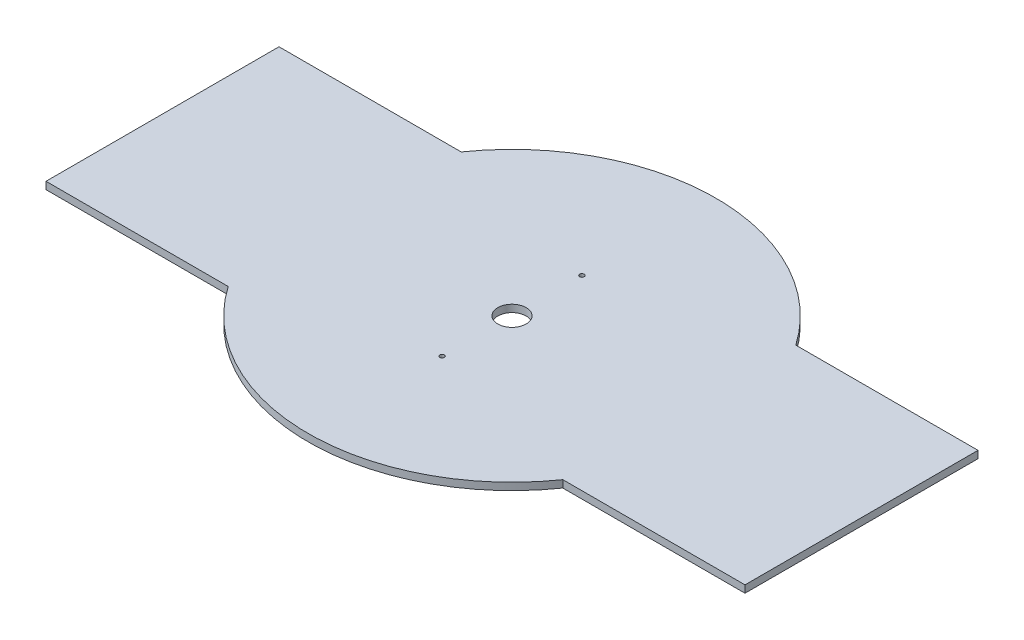
ISO-10303-21;
HEADER;
FILE_DESCRIPTION(('STEP AP214'),'2;1');
FILE_NAME('part.step','',(''),(''),'','','');
FILE_SCHEMA(('AUTOMOTIVE_DESIGN { 1 0 10303 214 1 1 1 1 }'));
ENDSEC;
DATA;
#1=APPLICATION_CONTEXT('core data for automotive mechanical design processes');
#2=APPLICATION_PROTOCOL_DEFINITION('international standard','automotive_design',2000,#1);
#3=PRODUCT_CONTEXT('',#1,'mechanical');
#4=PRODUCT('Part','Part','',(#3));
#5=PRODUCT_RELATED_PRODUCT_CATEGORY('part','',(#4));
#6=PRODUCT_DEFINITION_FORMATION('','',#4);
#7=PRODUCT_DEFINITION_CONTEXT('part definition',#1,'design');
#8=PRODUCT_DEFINITION('design','',#6,#7);
#9=PRODUCT_DEFINITION_SHAPE('','',#8);
#10=(LENGTH_UNIT() NAMED_UNIT(*) SI_UNIT(.MILLI.,.METRE.));
#11=(NAMED_UNIT(*) PLANE_ANGLE_UNIT() SI_UNIT($,.RADIAN.));
#12=(NAMED_UNIT(*) SI_UNIT($,.STERADIAN.) SOLID_ANGLE_UNIT());
#13=UNCERTAINTY_MEASURE_WITH_UNIT(LENGTH_MEASURE(1.E-05),#10,'distance_accuracy_value','');
#14=(GEOMETRIC_REPRESENTATION_CONTEXT(3) GLOBAL_UNCERTAINTY_ASSIGNED_CONTEXT((#13)) GLOBAL_UNIT_ASSIGNED_CONTEXT((#10,
#11,#12)) REPRESENTATION_CONTEXT('',''));
#15=CARTESIAN_POINT('',(0.,0.,0.));
#16=DIRECTION('',(0.,0.,1.));
#17=DIRECTION('',(1.,0.,0.));
#18=AXIS2_PLACEMENT_3D('',#15,#16,#17);
#19=CARTESIAN_POINT('',(0.,2.5,0.));
#20=DIRECTION('',(0.,-1.,0.));
#21=DIRECTION('',(0.,0.,-1.));
#22=AXIS2_PLACEMENT_3D('',#19,#20,#21);
#23=CYLINDRICAL_SURFACE('',#22,70.);
#24=CARTESIAN_POINT('',(0.,0.,0.));
#25=DIRECTION('',(0.,1.,0.));
#26=DIRECTION('',(0.,0.,1.));
#27=AXIS2_PLACEMENT_3D('',#24,#25,#26);
#28=CIRCLE('',#27,70.);
#29=CARTESIAN_POINT('',(-57.4456264653803,0.,40.));
#30=VERTEX_POINT('',#29);
#31=CARTESIAN_POINT('',(57.4456264653803,0.,40.));
#32=VERTEX_POINT('',#31);
#33=EDGE_CURVE('E162',#30,#32,#28,.T.);
#34=ORIENTED_EDGE('',*,*,#33,.T.);
#35=DIRECTION('',(0.,-1.,0.));
#36=VECTOR('',#35,1.);
#37=CARTESIAN_POINT('',(57.4456264653803,2.5,40.));
#38=LINE('',#37,#36);
#39=CARTESIAN_POINT('',(57.4456264653803,2.5,40.));
#40=VERTEX_POINT('',#39);
#41=EDGE_CURVE('E11',#40,#32,#38,.T.);
#42=ORIENTED_EDGE('',*,*,#41,.F.);
#43=CARTESIAN_POINT('',(0.,2.5,0.));
#44=DIRECTION('',(0.,1.,0.));
#45=DIRECTION('',(0.,0.,1.));
#46=AXIS2_PLACEMENT_3D('',#43,#44,#45);
#47=CIRCLE('',#46,70.);
#48=CARTESIAN_POINT('',(-57.4456264653803,2.5,40.));
#49=VERTEX_POINT('',#48);
#50=EDGE_CURVE('E200',#49,#40,#47,.T.);
#51=ORIENTED_EDGE('',*,*,#50,.F.);
#52=DIRECTION('',(0.,-1.,0.));
#53=VECTOR('',#52,1.);
#54=CARTESIAN_POINT('',(-57.4456264653803,2.5,40.));
#55=LINE('',#54,#53);
#56=EDGE_CURVE('E161',#49,#30,#55,.T.);
#57=ORIENTED_EDGE('',*,*,#56,.T.);
#58=EDGE_LOOP('',(#34,#42,#51,#57));
#59=FACE_BOUND('',#58,.T.);
#60=ADVANCED_FACE('F45',(#59),#23,.T.);
#61=CARTESIAN_POINT('',(0.,2.5,40.));
#62=DIRECTION('',(0.,0.,-1.));
#63=DIRECTION('',(-1.,0.,0.));
#64=AXIS2_PLACEMENT_3D('',#61,#62,#63);
#65=PLANE('',#64);
#66=DIRECTION('',(1.,0.,0.));
#67=VECTOR('',#66,1.);
#68=CARTESIAN_POINT('',(0.,0.,40.));
#69=LINE('',#68,#67);
#70=CARTESIAN_POINT('',(120.,0.,40.));
#71=VERTEX_POINT('',#70);
#72=EDGE_CURVE('E166',#32,#71,#69,.T.);
#73=ORIENTED_EDGE('',*,*,#72,.T.);
#74=DIRECTION('',(0.,-1.,0.));
#75=VECTOR('',#74,1.);
#76=CARTESIAN_POINT('',(120.,2.5,40.));
#77=LINE('',#76,#75);
#78=CARTESIAN_POINT('',(120.,2.5,40.));
#79=VERTEX_POINT('',#78);
#80=EDGE_CURVE('E54',#79,#71,#77,.T.);
#81=ORIENTED_EDGE('',*,*,#80,.F.);
#82=DIRECTION('',(1.,0.,0.));
#83=VECTOR('',#82,1.);
#84=CARTESIAN_POINT('',(0.,2.5,40.));
#85=LINE('',#84,#83);
#86=EDGE_CURVE('E104',#40,#79,#85,.T.);
#87=ORIENTED_EDGE('',*,*,#86,.F.);
#88=ORIENTED_EDGE('',*,*,#41,.T.);
#89=EDGE_LOOP('',(#73,#81,#87,#88));
#90=FACE_BOUND('',#89,.T.);
#91=ADVANCED_FACE('F219',(#90),#65,.F.);
#92=CARTESIAN_POINT('',(120.,2.5,0.));
#93=DIRECTION('',(1.,0.,0.));
#94=DIRECTION('',(0.,0.,-1.));
#95=AXIS2_PLACEMENT_3D('',#92,#93,#94);
#96=PLANE('',#95);
#97=DIRECTION('',(0.,0.,1.));
#98=VECTOR('',#97,1.);
#99=CARTESIAN_POINT('',(120.,0.,0.));
#100=LINE('',#99,#98);
#101=CARTESIAN_POINT('',(120.,0.,-40.));
#102=VERTEX_POINT('',#101);
#103=EDGE_CURVE('E170',#102,#71,#100,.T.);
#104=ORIENTED_EDGE('',*,*,#103,.F.);
#105=DIRECTION('',(0.,-1.,0.));
#106=VECTOR('',#105,1.);
#107=CARTESIAN_POINT('',(120.,2.5,-40.));
#108=LINE('',#107,#106);
#109=CARTESIAN_POINT('',(120.,2.5,-40.));
#110=VERTEX_POINT('',#109);
#111=EDGE_CURVE('E210',#110,#102,#108,.T.);
#112=ORIENTED_EDGE('',*,*,#111,.F.);
#113=DIRECTION('',(0.,0.,1.));
#114=VECTOR('',#113,1.);
#115=CARTESIAN_POINT('',(120.,2.5,0.));
#116=LINE('',#115,#114);
#117=EDGE_CURVE('E218',#110,#79,#116,.T.);
#118=ORIENTED_EDGE('',*,*,#117,.T.);
#119=ORIENTED_EDGE('',*,*,#80,.T.);
#120=EDGE_LOOP('',(#104,#112,#118,#119));
#121=FACE_BOUND('',#120,.T.);
#122=ADVANCED_FACE('F216',(#121),#96,.T.);
#123=CARTESIAN_POINT('',(0.,2.5,-40.));
#124=DIRECTION('',(0.,0.,-1.));
#125=DIRECTION('',(-1.,0.,0.));
#126=AXIS2_PLACEMENT_3D('',#123,#124,#125);
#127=PLANE('',#126);
#128=DIRECTION('',(1.,0.,0.));
#129=VECTOR('',#128,1.);
#130=CARTESIAN_POINT('',(0.,0.,-40.));
#131=LINE('',#130,#129);
#132=CARTESIAN_POINT('',(57.4456264653803,0.,-40.));
#133=VERTEX_POINT('',#132);
#134=EDGE_CURVE('E174',#133,#102,#131,.T.);
#135=ORIENTED_EDGE('',*,*,#134,.F.);
#136=DIRECTION('',(0.,-1.,0.));
#137=VECTOR('',#136,1.);
#138=CARTESIAN_POINT('',(57.4456264653803,2.5,-40.));
#139=LINE('',#138,#137);
#140=CARTESIAN_POINT('',(57.4456264653803,2.5,-40.));
#141=VERTEX_POINT('',#140);
#142=EDGE_CURVE('E207',#141,#133,#139,.T.);
#143=ORIENTED_EDGE('',*,*,#142,.F.);
#144=DIRECTION('',(1.,0.,0.));
#145=VECTOR('',#144,1.);
#146=CARTESIAN_POINT('',(0.,2.5,-40.));
#147=LINE('',#146,#145);
#148=EDGE_CURVE('E143',#141,#110,#147,.T.);
#149=ORIENTED_EDGE('',*,*,#148,.T.);
#150=ORIENTED_EDGE('',*,*,#111,.T.);
#151=EDGE_LOOP('',(#135,#143,#149,#150));
#152=FACE_BOUND('',#151,.T.);
#153=ADVANCED_FACE('F228',(#152),#127,.T.);
#154=CARTESIAN_POINT('',(0.,2.5,0.));
#155=DIRECTION('',(0.,-1.,0.));
#156=DIRECTION('',(0.,0.,-1.));
#157=AXIS2_PLACEMENT_3D('',#154,#155,#156);
#158=CYLINDRICAL_SURFACE('',#157,70.);
#159=CARTESIAN_POINT('',(0.,0.,0.));
#160=DIRECTION('',(0.,1.,0.));
#161=DIRECTION('',(0.,0.,1.));
#162=AXIS2_PLACEMENT_3D('',#159,#160,#161);
#163=CIRCLE('',#162,70.);
#164=CARTESIAN_POINT('',(-57.4456264653803,0.,-40.));
#165=VERTEX_POINT('',#164);
#166=EDGE_CURVE('E178',#133,#165,#163,.T.);
#167=ORIENTED_EDGE('',*,*,#166,.T.);
#168=DIRECTION('',(0.,-1.,0.));
#169=VECTOR('',#168,1.);
#170=CARTESIAN_POINT('',(-57.4456264653803,2.5,-40.));
#171=LINE('',#170,#169);
#172=CARTESIAN_POINT('',(-57.4456264653803,2.5,-40.));
#173=VERTEX_POINT('',#172);
#174=EDGE_CURVE('E127',#173,#165,#171,.T.);
#175=ORIENTED_EDGE('',*,*,#174,.F.);
#176=CARTESIAN_POINT('',(0.,2.5,0.));
#177=DIRECTION('',(0.,1.,0.));
#178=DIRECTION('',(0.,0.,1.));
#179=AXIS2_PLACEMENT_3D('',#176,#177,#178);
#180=CIRCLE('',#179,70.);
#181=EDGE_CURVE('E138',#141,#173,#180,.T.);
#182=ORIENTED_EDGE('',*,*,#181,.F.);
#183=ORIENTED_EDGE('',*,*,#142,.T.);
#184=EDGE_LOOP('',(#167,#175,#182,#183));
#185=FACE_BOUND('',#184,.T.);
#186=ADVANCED_FACE('F265',(#185),#158,.T.);
#187=CARTESIAN_POINT('',(0.,2.5,-40.));
#188=DIRECTION('',(0.,0.,-1.));
#189=DIRECTION('',(-1.,0.,0.));
#190=AXIS2_PLACEMENT_3D('',#187,#188,#189);
#191=PLANE('',#190);
#192=DIRECTION('',(1.,0.,0.));
#193=VECTOR('',#192,1.);
#194=CARTESIAN_POINT('',(0.,0.,-40.));
#195=LINE('',#194,#193);
#196=CARTESIAN_POINT('',(-120.,0.,-40.));
#197=VERTEX_POINT('',#196);
#198=EDGE_CURVE('E125',#197,#165,#195,.T.);
#199=ORIENTED_EDGE('',*,*,#198,.F.);
#200=DIRECTION('',(0.,-1.,0.));
#201=VECTOR('',#200,1.);
#202=CARTESIAN_POINT('',(-120.,2.5,-40.));
#203=LINE('',#202,#201);
#204=CARTESIAN_POINT('',(-120.,2.5,-40.));
#205=VERTEX_POINT('',#204);
#206=EDGE_CURVE('E119',#205,#197,#203,.T.);
#207=ORIENTED_EDGE('',*,*,#206,.F.);
#208=DIRECTION('',(1.,0.,0.));
#209=VECTOR('',#208,1.);
#210=CARTESIAN_POINT('',(0.,2.5,-40.));
#211=LINE('',#210,#209);
#212=EDGE_CURVE('E123',#205,#173,#211,.T.);
#213=ORIENTED_EDGE('',*,*,#212,.T.);
#214=ORIENTED_EDGE('',*,*,#174,.T.);
#215=EDGE_LOOP('',(#199,#207,#213,#214));
#216=FACE_BOUND('',#215,.T.);
#217=ADVANCED_FACE('F121',(#216),#191,.T.);
#218=CARTESIAN_POINT('',(-120.,2.5,0.));
#219=DIRECTION('',(1.,0.,0.));
#220=DIRECTION('',(0.,0.,-1.));
#221=AXIS2_PLACEMENT_3D('',#218,#219,#220);
#222=PLANE('',#221);
#223=DIRECTION('',(0.,0.,1.));
#224=VECTOR('',#223,1.);
#225=CARTESIAN_POINT('',(-120.,0.,0.));
#226=LINE('',#225,#224);
#227=CARTESIAN_POINT('',(-120.,0.,40.));
#228=VERTEX_POINT('',#227);
#229=EDGE_CURVE('E90',#197,#228,#226,.T.);
#230=ORIENTED_EDGE('',*,*,#229,.T.);
#231=DIRECTION('',(0.,-1.,0.));
#232=VECTOR('',#231,1.);
#233=CARTESIAN_POINT('',(-120.,2.5,40.));
#234=LINE('',#233,#232);
#235=CARTESIAN_POINT('',(-120.,2.5,40.));
#236=VERTEX_POINT('',#235);
#237=EDGE_CURVE('E128',#236,#228,#234,.T.);
#238=ORIENTED_EDGE('',*,*,#237,.F.);
#239=DIRECTION('',(0.,0.,1.));
#240=VECTOR('',#239,1.);
#241=CARTESIAN_POINT('',(-120.,2.5,0.));
#242=LINE('',#241,#240);
#243=EDGE_CURVE('E130',#205,#236,#242,.T.);
#244=ORIENTED_EDGE('',*,*,#243,.F.);
#245=ORIENTED_EDGE('',*,*,#206,.T.);
#246=EDGE_LOOP('',(#230,#238,#244,#245));
#247=FACE_BOUND('',#246,.T.);
#248=ADVANCED_FACE('F131',(#247),#222,.F.);
#249=CARTESIAN_POINT('',(0.,2.5,-24.));
#250=DIRECTION('',(0.,-1.,0.));
#251=DIRECTION('',(0.,0.,-1.));
#252=AXIS2_PLACEMENT_3D('',#249,#250,#251);
#253=CYLINDRICAL_SURFACE('',#252,0.775);
#254=CARTESIAN_POINT('',(0.,2.5,-24.));
#255=DIRECTION('',(0.,1.,0.));
#256=DIRECTION('',(0.,0.,1.));
#257=AXIS2_PLACEMENT_3D('',#254,#255,#256);
#258=CIRCLE('',#257,0.775);
#259=CARTESIAN_POINT('',(0.,2.5,-23.225));
#260=VERTEX_POINT('',#259);
#261=EDGE_CURVE('E153',#260,#260,#258,.T.);
#262=ORIENTED_EDGE('',*,*,#261,.T.);
#263=EDGE_LOOP('',(#262));
#264=FACE_BOUND('',#263,.T.);
#265=CARTESIAN_POINT('',(0.,0.,-24.));
#266=DIRECTION('',(0.,1.,0.));
#267=DIRECTION('',(0.,0.,1.));
#268=AXIS2_PLACEMENT_3D('',#265,#266,#267);
#269=CIRCLE('',#268,0.775);
#270=CARTESIAN_POINT('',(0.,0.,-23.225));
#271=VERTEX_POINT('',#270);
#272=EDGE_CURVE('E192',#271,#271,#269,.T.);
#273=ORIENTED_EDGE('',*,*,#272,.F.);
#274=EDGE_LOOP('',(#273));
#275=FACE_BOUND('',#274,.T.);
#276=ADVANCED_FACE('F250',(#264,#275),#253,.F.);
#277=CARTESIAN_POINT('',(0.,2.5,24.));
#278=DIRECTION('',(0.,-1.,0.));
#279=DIRECTION('',(0.,0.,-1.));
#280=AXIS2_PLACEMENT_3D('',#277,#278,#279);
#281=CYLINDRICAL_SURFACE('',#280,0.775);
#282=CARTESIAN_POINT('',(0.,2.5,24.));
#283=DIRECTION('',(0.,1.,0.));
#284=DIRECTION('',(0.,0.,1.));
#285=AXIS2_PLACEMENT_3D('',#282,#283,#284);
#286=CIRCLE('',#285,0.775);
#287=CARTESIAN_POINT('',(0.,2.5,24.775));
#288=VERTEX_POINT('',#287);
#289=EDGE_CURVE('E149',#288,#288,#286,.T.);
#290=ORIENTED_EDGE('',*,*,#289,.T.);
#291=EDGE_LOOP('',(#290));
#292=FACE_BOUND('',#291,.T.);
#293=CARTESIAN_POINT('',(0.,0.,24.));
#294=DIRECTION('',(0.,1.,0.));
#295=DIRECTION('',(0.,0.,1.));
#296=AXIS2_PLACEMENT_3D('',#293,#294,#295);
#297=CIRCLE('',#296,0.775);
#298=CARTESIAN_POINT('',(0.,0.,24.775));
#299=VERTEX_POINT('',#298);
#300=EDGE_CURVE('E188',#299,#299,#297,.T.);
#301=ORIENTED_EDGE('',*,*,#300,.F.);
#302=EDGE_LOOP('',(#301));
#303=FACE_BOUND('',#302,.T.);
#304=ADVANCED_FACE('F242',(#292,#303),#281,.F.);
#305=CARTESIAN_POINT('',(0.,2.5,40.));
#306=DIRECTION('',(0.,0.,-1.));
#307=DIRECTION('',(-1.,0.,0.));
#308=AXIS2_PLACEMENT_3D('',#305,#306,#307);
#309=PLANE('',#308);
#310=DIRECTION('',(1.,0.,0.));
#311=VECTOR('',#310,1.);
#312=CARTESIAN_POINT('',(0.,0.,40.));
#313=LINE('',#312,#311);
#314=EDGE_CURVE('E96',#228,#30,#313,.T.);
#315=ORIENTED_EDGE('',*,*,#314,.T.);
#316=ORIENTED_EDGE('',*,*,#56,.F.);
#317=DIRECTION('',(1.,0.,0.));
#318=VECTOR('',#317,1.);
#319=CARTESIAN_POINT('',(0.,2.5,40.));
#320=LINE('',#319,#318);
#321=EDGE_CURVE('E62',#236,#49,#320,.T.);
#322=ORIENTED_EDGE('',*,*,#321,.F.);
#323=ORIENTED_EDGE('',*,*,#237,.T.);
#324=EDGE_LOOP('',(#315,#316,#322,#323));
#325=FACE_BOUND('',#324,.T.);
#326=ADVANCED_FACE('F239',(#325),#309,.F.);
#327=CARTESIAN_POINT('',(0.,2.5,0.));
#328=DIRECTION('',(0.,-1.,0.));
#329=DIRECTION('',(0.,0.,-1.));
#330=AXIS2_PLACEMENT_3D('',#327,#328,#329);
#331=CYLINDRICAL_SURFACE('',#330,4.875);
#332=CARTESIAN_POINT('',(0.,2.5,0.));
#333=DIRECTION('',(0.,1.,0.));
#334=DIRECTION('',(0.,0.,1.));
#335=AXIS2_PLACEMENT_3D('',#332,#333,#334);
#336=CIRCLE('',#335,4.875);
#337=CARTESIAN_POINT('',(0.,2.5,4.875));
#338=VERTEX_POINT('',#337);
#339=EDGE_CURVE('E157',#338,#338,#336,.T.);
#340=ORIENTED_EDGE('',*,*,#339,.T.);
#341=EDGE_LOOP('',(#340));
#342=FACE_BOUND('',#341,.T.);
#343=CARTESIAN_POINT('',(0.,0.,0.));
#344=DIRECTION('',(0.,1.,0.));
#345=DIRECTION('',(0.,0.,1.));
#346=AXIS2_PLACEMENT_3D('',#343,#344,#345);
#347=CIRCLE('',#346,4.875);
#348=CARTESIAN_POINT('',(0.,0.,4.875));
#349=VERTEX_POINT('',#348);
#350=EDGE_CURVE('E196',#349,#349,#347,.T.);
#351=ORIENTED_EDGE('',*,*,#350,.F.);
#352=EDGE_LOOP('',(#351));
#353=FACE_BOUND('',#352,.T.);
#354=ADVANCED_FACE('F241',(#342,#353),#331,.F.);
#355=CARTESIAN_POINT('',(0.,2.5,0.));
#356=DIRECTION('',(0.,1.,0.));
#357=DIRECTION('',(0.,0.,1.));
#358=AXIS2_PLACEMENT_3D('',#355,#356,#357);
#359=PLANE('',#358);
#360=ORIENTED_EDGE('',*,*,#50,.T.);
#361=ORIENTED_EDGE('',*,*,#86,.T.);
#362=ORIENTED_EDGE('',*,*,#117,.F.);
#363=ORIENTED_EDGE('',*,*,#148,.F.);
#364=ORIENTED_EDGE('',*,*,#181,.T.);
#365=ORIENTED_EDGE('',*,*,#212,.F.);
#366=ORIENTED_EDGE('',*,*,#243,.T.);
#367=ORIENTED_EDGE('',*,*,#321,.T.);
#368=EDGE_LOOP('',(#360,#361,#362,#363,#364,#365,#366,#367));
#369=FACE_BOUND('',#368,.T.);
#370=ORIENTED_EDGE('',*,*,#289,.F.);
#371=EDGE_LOOP('',(#370));
#372=FACE_BOUND('',#371,.T.);
#373=ORIENTED_EDGE('',*,*,#261,.F.);
#374=EDGE_LOOP('',(#373));
#375=FACE_BOUND('',#374,.T.);
#376=ORIENTED_EDGE('',*,*,#339,.F.);
#377=EDGE_LOOP('',(#376));
#378=FACE_BOUND('',#377,.T.);
#379=ADVANCED_FACE('F134',(#369,#372,#375,#378),#359,.T.);
#380=CARTESIAN_POINT('',(0.,0.,0.));
#381=DIRECTION('',(0.,1.,0.));
#382=DIRECTION('',(0.,0.,1.));
#383=AXIS2_PLACEMENT_3D('',#380,#381,#382);
#384=PLANE('',#383);
#385=ORIENTED_EDGE('',*,*,#33,.F.);
#386=ORIENTED_EDGE('',*,*,#314,.F.);
#387=ORIENTED_EDGE('',*,*,#229,.F.);
#388=ORIENTED_EDGE('',*,*,#198,.T.);
#389=ORIENTED_EDGE('',*,*,#166,.F.);
#390=ORIENTED_EDGE('',*,*,#134,.T.);
#391=ORIENTED_EDGE('',*,*,#103,.T.);
#392=ORIENTED_EDGE('',*,*,#72,.F.);
#393=EDGE_LOOP('',(#385,#386,#387,#388,#389,#390,#391,#392));
#394=FACE_BOUND('',#393,.T.);
#395=ORIENTED_EDGE('',*,*,#300,.T.);
#396=EDGE_LOOP('',(#395));
#397=FACE_BOUND('',#396,.T.);
#398=ORIENTED_EDGE('',*,*,#272,.T.);
#399=EDGE_LOOP('',(#398));
#400=FACE_BOUND('',#399,.T.);
#401=ORIENTED_EDGE('',*,*,#350,.T.);
#402=EDGE_LOOP('',(#401));
#403=FACE_BOUND('',#402,.T.);
#404=ADVANCED_FACE('F223',(#394,#397,#400,#403),#384,.F.);
#405=CLOSED_SHELL('',(#60,#91,#122,#153,#186,#217,#248,#276,#304,#326,#354,#379,#404));
#406=MANIFOLD_SOLID_BREP('B2',#405);
#407=ADVANCED_BREP_SHAPE_REPRESENTATION('',(#18,#406),#14);
#408=SHAPE_DEFINITION_REPRESENTATION(#9,#407);
ENDSEC;
END-ISO-10303-21;
